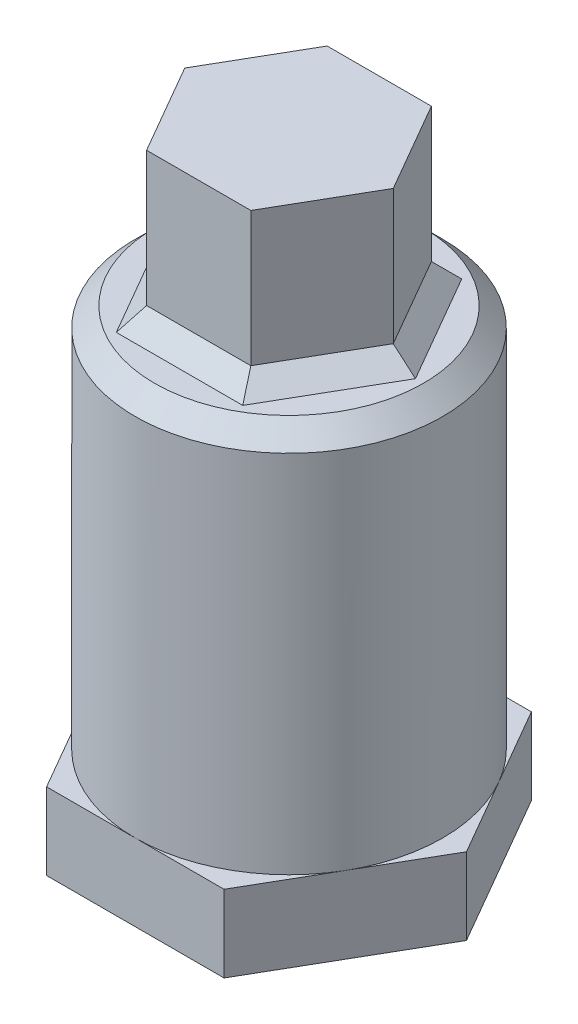
ISO-10303-21;
HEADER;
FILE_DESCRIPTION(('STEP AP214'),'2;1');
FILE_NAME('part.step','',(''),(''),'','','');
FILE_SCHEMA(('AUTOMOTIVE_DESIGN { 1 0 10303 214 1 1 1 1 }'));
ENDSEC;
DATA;
#1=APPLICATION_CONTEXT('core data for automotive mechanical design processes');
#2=APPLICATION_PROTOCOL_DEFINITION('international standard','automotive_design',2000,#1);
#3=PRODUCT_CONTEXT('',#1,'mechanical');
#4=PRODUCT('Part','Part','',(#3));
#5=PRODUCT_RELATED_PRODUCT_CATEGORY('part','',(#4));
#6=PRODUCT_DEFINITION_FORMATION('','',#4);
#7=PRODUCT_DEFINITION_CONTEXT('part definition',#1,'design');
#8=PRODUCT_DEFINITION('design','',#6,#7);
#9=PRODUCT_DEFINITION_SHAPE('','',#8);
#10=(LENGTH_UNIT() NAMED_UNIT(*) SI_UNIT(.MILLI.,.METRE.));
#11=(NAMED_UNIT(*) PLANE_ANGLE_UNIT() SI_UNIT($,.RADIAN.));
#12=(NAMED_UNIT(*) SI_UNIT($,.STERADIAN.) SOLID_ANGLE_UNIT());
#13=UNCERTAINTY_MEASURE_WITH_UNIT(LENGTH_MEASURE(1.E-05),#10,'distance_accuracy_value','');
#14=(GEOMETRIC_REPRESENTATION_CONTEXT(3) GLOBAL_UNCERTAINTY_ASSIGNED_CONTEXT((#13)) GLOBAL_UNIT_ASSIGNED_CONTEXT((#10,
#11,#12)) REPRESENTATION_CONTEXT('',''));
#15=CARTESIAN_POINT('',(0.,0.,0.));
#16=DIRECTION('',(0.,0.,1.));
#17=DIRECTION('',(1.,0.,0.));
#18=AXIS2_PLACEMENT_3D('',#15,#16,#17);
#19=CARTESIAN_POINT('',(2.71354626519129,8.,4.69999999999995));
#20=DIRECTION('',(-0.866025403784441,0.,-0.499999999999995));
#21=DIRECTION('',(-0.499999999999995,0.,0.866025403784442));
#22=AXIS2_PLACEMENT_3D('',#19,#20,#21);
#23=PLANE('',#22);
#24=DIRECTION('',(0.,-1.,0.));
#25=VECTOR('',#24,1.);
#26=CARTESIAN_POINT('',(2.71354626519129,8.,4.69999999999995));
#27=LINE('',#26,#25);
#28=CARTESIAN_POINT('',(2.71354626519129,8.,4.69999999999995));
#29=VERTEX_POINT('',#28);
#30=CARTESIAN_POINT('',(2.71354626519129,1.00000000000001,4.69999999999995));
#31=VERTEX_POINT('',#30);
#32=EDGE_CURVE('E235',#29,#31,#27,.T.);
#33=ORIENTED_EDGE('',*,*,#32,.T.);
#34=DIRECTION('',(0.499999999999995,0.,-0.866025403784442));
#35=VECTOR('',#34,1.);
#36=CARTESIAN_POINT('',(5.42709253038246,1.00000000000001,0.));
#37=LINE('',#36,#35);
#38=CARTESIAN_POINT('',(5.42709253038246,1.00000000000001,0.));
#39=VERTEX_POINT('',#38);
#40=EDGE_CURVE('E11',#31,#39,#37,.T.);
#41=ORIENTED_EDGE('',*,*,#40,.T.);
#42=DIRECTION('',(0.,-1.,0.));
#43=VECTOR('',#42,1.);
#44=CARTESIAN_POINT('',(5.42709253038246,8.,0.));
#45=LINE('',#44,#43);
#46=CARTESIAN_POINT('',(5.42709253038246,8.,0.));
#47=VERTEX_POINT('',#46);
#48=EDGE_CURVE('E253',#47,#39,#45,.T.);
#49=ORIENTED_EDGE('',*,*,#48,.F.);
#50=DIRECTION('',(0.499999999999995,0.,-0.866025403784441));
#51=VECTOR('',#50,1.);
#52=CARTESIAN_POINT('',(2.71354626519129,8.,4.69999999999995));
#53=LINE('',#52,#51);
#54=EDGE_CURVE('E216',#29,#47,#53,.T.);
#55=ORIENTED_EDGE('',*,*,#54,.F.);
#56=EDGE_LOOP('',(#33,#41,#49,#55));
#57=FACE_BOUND('',#56,.T.);
#58=ADVANCED_FACE('F41',(#57),#23,.F.);
#59=CARTESIAN_POINT('',(5.42709253038246,8.,0.));
#60=DIRECTION('',(-0.866025403784438,0.,0.500000000000001));
#61=DIRECTION('',(0.500000000000001,0.,0.866025403784438));
#62=AXIS2_PLACEMENT_3D('',#59,#60,#61);
#63=PLANE('',#62);
#64=ORIENTED_EDGE('',*,*,#48,.T.);
#65=DIRECTION('',(-0.500000000000001,0.,-0.866025403784438));
#66=VECTOR('',#65,1.);
#67=CARTESIAN_POINT('',(2.71354626519122,1.00000000000001,-4.69999999999999));
#68=LINE('',#67,#66);
#69=CARTESIAN_POINT('',(2.71354626519122,1.00000000000001,-4.69999999999999));
#70=VERTEX_POINT('',#69);
#71=EDGE_CURVE('E284',#39,#70,#68,.T.);
#72=ORIENTED_EDGE('',*,*,#71,.T.);
#73=DIRECTION('',(0.,-1.,0.));
#74=VECTOR('',#73,1.);
#75=CARTESIAN_POINT('',(2.71354626519122,8.,-4.69999999999999));
#76=LINE('',#75,#74);
#77=CARTESIAN_POINT('',(2.71354626519122,8.,-4.69999999999999));
#78=VERTEX_POINT('',#77);
#79=EDGE_CURVE('E249',#78,#70,#76,.T.);
#80=ORIENTED_EDGE('',*,*,#79,.F.);
#81=DIRECTION('',(-0.500000000000001,0.,-0.866025403784438));
#82=VECTOR('',#81,1.);
#83=CARTESIAN_POINT('',(5.42709253038246,8.,0.));
#84=LINE('',#83,#82);
#85=EDGE_CURVE('E220',#47,#78,#84,.T.);
#86=ORIENTED_EDGE('',*,*,#85,.F.);
#87=EDGE_LOOP('',(#64,#72,#80,#86));
#88=FACE_BOUND('',#87,.T.);
#89=ADVANCED_FACE('F342',(#88),#63,.F.);
#90=CARTESIAN_POINT('',(2.71354626519122,8.,-4.69999999999999));
#91=DIRECTION('',(0.,0.,1.));
#92=DIRECTION('',(1.,0.,0.));
#93=AXIS2_PLACEMENT_3D('',#90,#91,#92);
#94=PLANE('',#93);
#95=ORIENTED_EDGE('',*,*,#79,.T.);
#96=DIRECTION('',(-1.,0.,0.));
#97=VECTOR('',#96,1.);
#98=CARTESIAN_POINT('',(-2.71354626519125,1.00000000000001,-4.69999999999997));
#99=LINE('',#98,#97);
#100=CARTESIAN_POINT('',(-2.71354626519125,1.00000000000001,-4.69999999999997));
#101=VERTEX_POINT('',#100);
#102=EDGE_CURVE('E288',#70,#101,#99,.T.);
#103=ORIENTED_EDGE('',*,*,#102,.T.);
#104=DIRECTION('',(0.,-1.,0.));
#105=VECTOR('',#104,1.);
#106=CARTESIAN_POINT('',(-2.71354626519125,8.,-4.69999999999997));
#107=LINE('',#106,#105);
#108=CARTESIAN_POINT('',(-2.71354626519125,8.,-4.69999999999997));
#109=VERTEX_POINT('',#108);
#110=EDGE_CURVE('E245',#109,#101,#107,.T.);
#111=ORIENTED_EDGE('',*,*,#110,.F.);
#112=DIRECTION('',(-1.,0.,0.));
#113=VECTOR('',#112,1.);
#114=CARTESIAN_POINT('',(2.71354626519122,8.,-4.69999999999999));
#115=LINE('',#114,#113);
#116=EDGE_CURVE('E223',#78,#109,#115,.T.);
#117=ORIENTED_EDGE('',*,*,#116,.F.);
#118=EDGE_LOOP('',(#95,#103,#111,#117));
#119=FACE_BOUND('',#118,.T.);
#120=ADVANCED_FACE('F368',(#119),#94,.F.);
#121=CARTESIAN_POINT('',(-2.71354626519125,8.,-4.69999999999997));
#122=DIRECTION('',(0.866025403784442,0.,0.499999999999995));
#123=DIRECTION('',(0.499999999999995,0.,-0.866025403784442));
#124=AXIS2_PLACEMENT_3D('',#121,#122,#123);
#125=PLANE('',#124);
#126=ORIENTED_EDGE('',*,*,#110,.T.);
#127=DIRECTION('',(-0.499999999999995,0.,0.866025403784442));
#128=VECTOR('',#127,1.);
#129=CARTESIAN_POINT('',(-5.42709253038246,1.00000000000001,0.));
#130=LINE('',#129,#128);
#131=CARTESIAN_POINT('',(-5.42709253038246,1.00000000000001,0.));
#132=VERTEX_POINT('',#131);
#133=EDGE_CURVE('E291',#101,#132,#130,.T.);
#134=ORIENTED_EDGE('',*,*,#133,.T.);
#135=DIRECTION('',(0.,-1.,0.));
#136=VECTOR('',#135,1.);
#137=CARTESIAN_POINT('',(-5.42709253038246,8.,0.));
#138=LINE('',#137,#136);
#139=CARTESIAN_POINT('',(-5.42709253038246,8.,0.));
#140=VERTEX_POINT('',#139);
#141=EDGE_CURVE('E241',#140,#132,#138,.T.);
#142=ORIENTED_EDGE('',*,*,#141,.F.);
#143=DIRECTION('',(-0.499999999999995,0.,0.866025403784442));
#144=VECTOR('',#143,1.);
#145=CARTESIAN_POINT('',(-2.71354626519125,8.,-4.69999999999997));
#146=LINE('',#145,#144);
#147=EDGE_CURVE('E226',#109,#140,#146,.T.);
#148=ORIENTED_EDGE('',*,*,#147,.F.);
#149=EDGE_LOOP('',(#126,#134,#142,#148));
#150=FACE_BOUND('',#149,.T.);
#151=ADVANCED_FACE('F360',(#150),#125,.F.);
#152=CARTESIAN_POINT('',(-5.42709253038246,8.,0.));
#153=DIRECTION('',(0.866025403784435,0.,-0.500000000000007));
#154=DIRECTION('',(-0.500000000000007,0.,-0.866025403784434));
#155=AXIS2_PLACEMENT_3D('',#152,#153,#154);
#156=PLANE('',#155);
#157=ORIENTED_EDGE('',*,*,#141,.T.);
#158=DIRECTION('',(0.500000000000007,0.,0.866025403784434));
#159=VECTOR('',#158,1.);
#160=CARTESIAN_POINT('',(-2.71354626519119,1.00000000000001,4.70000000000001));
#161=LINE('',#160,#159);
#162=CARTESIAN_POINT('',(-2.71354626519119,1.00000000000001,4.70000000000001));
#163=VERTEX_POINT('',#162);
#164=EDGE_CURVE('E294',#132,#163,#161,.T.);
#165=ORIENTED_EDGE('',*,*,#164,.T.);
#166=DIRECTION('',(0.,-1.,0.));
#167=VECTOR('',#166,1.);
#168=CARTESIAN_POINT('',(-2.71354626519119,8.,4.70000000000001));
#169=LINE('',#168,#167);
#170=CARTESIAN_POINT('',(-2.71354626519119,8.,4.70000000000001));
#171=VERTEX_POINT('',#170);
#172=EDGE_CURVE('E238',#171,#163,#169,.T.);
#173=ORIENTED_EDGE('',*,*,#172,.F.);
#174=DIRECTION('',(0.500000000000007,0.,0.866025403784434));
#175=VECTOR('',#174,1.);
#176=CARTESIAN_POINT('',(-5.42709253038246,8.,0.));
#177=LINE('',#176,#175);
#178=EDGE_CURVE('E229',#140,#171,#177,.T.);
#179=ORIENTED_EDGE('',*,*,#178,.F.);
#180=EDGE_LOOP('',(#157,#165,#173,#179));
#181=FACE_BOUND('',#180,.T.);
#182=ADVANCED_FACE('F352',(#181),#156,.F.);
#183=CARTESIAN_POINT('',(-2.71354626519119,8.,4.70000000000001));
#184=DIRECTION('',(0.,0.,-1.));
#185=DIRECTION('',(-1.,0.,0.));
#186=AXIS2_PLACEMENT_3D('',#183,#184,#185);
#187=PLANE('',#186);
#188=ORIENTED_EDGE('',*,*,#172,.T.);
#189=DIRECTION('',(1.,0.,0.));
#190=VECTOR('',#189,1.);
#191=CARTESIAN_POINT('',(2.71354626519129,1.00000000000001,4.69999999999995));
#192=LINE('',#191,#190);
#193=EDGE_CURVE('E52',#163,#31,#192,.T.);
#194=ORIENTED_EDGE('',*,*,#193,.T.);
#195=ORIENTED_EDGE('',*,*,#32,.F.);
#196=DIRECTION('',(1.,0.,0.));
#197=VECTOR('',#196,1.);
#198=CARTESIAN_POINT('',(-2.71354626519119,8.,4.70000000000001));
#199=LINE('',#198,#197);
#200=EDGE_CURVE('E232',#171,#29,#199,.T.);
#201=ORIENTED_EDGE('',*,*,#200,.F.);
#202=EDGE_LOOP('',(#188,#194,#195,#201));
#203=FACE_BOUND('',#202,.T.);
#204=ADVANCED_FACE('F350',(#203),#187,.F.);
#205=CARTESIAN_POINT('',(0.,8.,0.));
#206=DIRECTION('',(0.,1.,0.));
#207=DIRECTION('',(0.,0.,1.));
#208=AXIS2_PLACEMENT_3D('',#205,#206,#207);
#209=PLANE('',#208);
#210=ORIENTED_EDGE('',*,*,#54,.T.);
#211=ORIENTED_EDGE('',*,*,#85,.T.);
#212=ORIENTED_EDGE('',*,*,#116,.T.);
#213=ORIENTED_EDGE('',*,*,#147,.T.);
#214=ORIENTED_EDGE('',*,*,#178,.T.);
#215=ORIENTED_EDGE('',*,*,#200,.T.);
#216=EDGE_LOOP('',(#210,#211,#212,#213,#214,#215));
#217=FACE_BOUND('',#216,.T.);
#218=ADVANCED_FACE('F346',(#217),#209,.T.);
#219=CARTESIAN_POINT('',(0.,-20.,0.));
#220=DIRECTION('',(0.,1.,0.));
#221=DIRECTION('',(0.,0.,1.));
#222=AXIS2_PLACEMENT_3D('',#219,#220,#221);
#223=CYLINDRICAL_SURFACE('',#222,8.);
#224=CARTESIAN_POINT('',(0.,-0.99999999999999,0.));
#225=DIRECTION('',(0.,-1.,0.));
#226=DIRECTION('',(0.,0.,-1.));
#227=AXIS2_PLACEMENT_3D('',#224,#225,#226);
#228=CIRCLE('',#227,8.);
#229=CARTESIAN_POINT('',(0.,-0.99999999999999,-8.));
#230=VERTEX_POINT('',#229);
#231=EDGE_CURVE('E257',#230,#230,#228,.T.);
#232=ORIENTED_EDGE('',*,*,#231,.T.);
#233=EDGE_LOOP('',(#232));
#234=FACE_BOUND('',#233,.T.);
#235=CARTESIAN_POINT('',(0.,-20.,0.));
#236=DIRECTION('',(0.,1.,0.));
#237=DIRECTION('',(0.,0.,1.));
#238=AXIS2_PLACEMENT_3D('',#235,#236,#237);
#239=CIRCLE('',#238,8.);
#240=CARTESIAN_POINT('',(0.,-20.,8.));
#241=VERTEX_POINT('',#240);
#242=CARTESIAN_POINT('',(6.92820323027551,-20.,4.));
#243=VERTEX_POINT('',#242);
#244=EDGE_CURVE('E207',#241,#243,#239,.T.);
#245=ORIENTED_EDGE('',*,*,#244,.T.);
#246=CARTESIAN_POINT('',(6.92820323027551,-20.,-4.));
#247=VERTEX_POINT('',#246);
#248=EDGE_CURVE('E215',#243,#247,#239,.T.);
#249=ORIENTED_EDGE('',*,*,#248,.T.);
#250=CARTESIAN_POINT('',(0.,-20.,-8.));
#251=VERTEX_POINT('',#250);
#252=EDGE_CURVE('E623',#247,#251,#239,.T.);
#253=ORIENTED_EDGE('',*,*,#252,.T.);
#254=CARTESIAN_POINT('',(-6.92820323027551,-20.,-4.));
#255=VERTEX_POINT('',#254);
#256=EDGE_CURVE('E620',#251,#255,#239,.T.);
#257=ORIENTED_EDGE('',*,*,#256,.T.);
#258=CARTESIAN_POINT('',(-6.92820323027551,-20.,4.));
#259=VERTEX_POINT('',#258);
#260=EDGE_CURVE('E205',#255,#259,#239,.T.);
#261=ORIENTED_EDGE('',*,*,#260,.T.);
#262=EDGE_CURVE('E200',#259,#241,#239,.T.);
#263=ORIENTED_EDGE('',*,*,#262,.T.);
#264=EDGE_LOOP('',(#245,#249,#253,#257,#261,#263));
#265=FACE_BOUND('',#264,.T.);
#266=ADVANCED_FACE('F358',(#234,#265),#223,.T.);
#267=CARTESIAN_POINT('',(0.,0.,0.));
#268=DIRECTION('',(0.,-1.,0.));
#269=DIRECTION('',(0.,0.,-1.));
#270=AXIS2_PLACEMENT_3D('',#267,#268,#269);
#271=PLANE('',#270);
#272=CARTESIAN_POINT('',(0.,0.,0.));
#273=DIRECTION('',(0.,-1.,0.));
#274=DIRECTION('',(0.,0.,-1.));
#275=AXIS2_PLACEMENT_3D('',#272,#273,#274);
#276=CIRCLE('',#275,7.00000000000001);
#277=CARTESIAN_POINT('',(0.,0.,-7.00000000000001));
#278=VERTEX_POINT('',#277);
#279=EDGE_CURVE('E280',#278,#278,#276,.F.);
#280=ORIENTED_EDGE('',*,*,#279,.T.);
#281=EDGE_LOOP('',(#280));
#282=FACE_BOUND('',#281,.T.);
#283=DIRECTION('',(1.,0.,0.));
#284=VECTOR('',#283,1.);
#285=CARTESIAN_POINT('',(2.71354626519122,0.,-5.69999999999999));
#286=LINE('',#285,#284);
#287=CARTESIAN_POINT('',(-3.29089653438088,0.,-5.69999999999997));
#288=VERTEX_POINT('',#287);
#289=CARTESIAN_POINT('',(3.29089653438085,0.,-5.69999999999999));
#290=VERTEX_POINT('',#289);
#291=EDGE_CURVE('E273',#288,#290,#286,.T.);
#292=ORIENTED_EDGE('',*,*,#291,.T.);
#293=DIRECTION('',(0.500000000000001,0.,0.866025403784438));
#294=VECTOR('',#293,1.);
#295=CARTESIAN_POINT('',(6.2931179341669,0.,-0.500000000000002));
#296=LINE('',#295,#294);
#297=CARTESIAN_POINT('',(6.58179306876172,0.,0.));
#298=VERTEX_POINT('',#297);
#299=EDGE_CURVE('E276',#290,#298,#296,.T.);
#300=ORIENTED_EDGE('',*,*,#299,.T.);
#301=DIRECTION('',(-0.499999999999995,0.,0.866025403784442));
#302=VECTOR('',#301,1.);
#303=CARTESIAN_POINT('',(3.57957166897573,0.,5.19999999999995));
#304=LINE('',#303,#302);
#305=CARTESIAN_POINT('',(3.29089653438092,0.,5.69999999999995));
#306=VERTEX_POINT('',#305);
#307=EDGE_CURVE('E261',#298,#306,#304,.T.);
#308=ORIENTED_EDGE('',*,*,#307,.T.);
#309=DIRECTION('',(-1.,0.,0.));
#310=VECTOR('',#309,1.);
#311=CARTESIAN_POINT('',(-2.71354626519118,0.,5.70000000000001));
#312=LINE('',#311,#310);
#313=CARTESIAN_POINT('',(-3.29089653438081,0.,5.70000000000002));
#314=VERTEX_POINT('',#313);
#315=EDGE_CURVE('E264',#306,#314,#312,.T.);
#316=ORIENTED_EDGE('',*,*,#315,.T.);
#317=DIRECTION('',(-0.500000000000007,0.,-0.866025403784435));
#318=VECTOR('',#317,1.);
#319=CARTESIAN_POINT('',(-6.2931179341669,0.,0.500000000000046));
#320=LINE('',#319,#318);
#321=CARTESIAN_POINT('',(-6.58179306876172,0.,0.));
#322=VERTEX_POINT('',#321);
#323=EDGE_CURVE('E267',#314,#322,#320,.T.);
#324=ORIENTED_EDGE('',*,*,#323,.T.);
#325=DIRECTION('',(0.499999999999995,0.,-0.866025403784442));
#326=VECTOR('',#325,1.);
#327=CARTESIAN_POINT('',(-3.5795716689757,0.,-5.19999999999997));
#328=LINE('',#327,#326);
#329=EDGE_CURVE('E270',#322,#288,#328,.T.);
#330=ORIENTED_EDGE('',*,*,#329,.T.);
#331=EDGE_LOOP('',(#292,#300,#308,#316,#324,#330));
#332=FACE_BOUND('',#331,.T.);
#333=ADVANCED_FACE('F329',(#282,#332),#271,.F.);
#334=CARTESIAN_POINT('',(0.,-0.99999999999999,0.));
#335=DIRECTION('',(0.,-1.,0.));
#336=DIRECTION('',(0.,0.,-1.));
#337=AXIS2_PLACEMENT_3D('',#334,#335,#336);
#338=CONICAL_SURFACE('',#337,8.,0.78539816339745);
#339=ORIENTED_EDGE('',*,*,#279,.F.);
#340=EDGE_LOOP('',(#339));
#341=FACE_BOUND('',#340,.T.);
#342=ORIENTED_EDGE('',*,*,#231,.F.);
#343=EDGE_LOOP('',(#342));
#344=FACE_BOUND('',#343,.T.);
#345=ADVANCED_FACE('F373',(#341,#344),#338,.T.);
#346=CARTESIAN_POINT('',(-5.42709253038246,1.00000000000001,0.));
#347=DIRECTION('',(-0.612372435695794,0.707106781186544,0.35355339059328));
#348=DIRECTION('',(-0.500000000000007,0.,-0.866025403784434));
#349=AXIS2_PLACEMENT_3D('',#346,#347,#348);
#350=PLANE('',#349);
#351=DIRECTION('',(-0.755928946018452,-0.65465367070798,0.));
#352=VECTOR('',#351,1.);
#353=CARTESIAN_POINT('',(-5.42709253038246,1.00000000000001,0.));
#354=LINE('',#353,#352);
#355=EDGE_CURVE('E311',#322,#132,#354,.F.);
#356=ORIENTED_EDGE('',*,*,#355,.F.);
#357=ORIENTED_EDGE('',*,*,#323,.F.);
#358=DIRECTION('',(-0.37796447300922,-0.65465367070798,0.654653670707978));
#359=VECTOR('',#358,1.);
#360=CARTESIAN_POINT('',(-2.71354626519119,1.00000000000001,4.70000000000001));
#361=LINE('',#360,#359);
#362=EDGE_CURVE('E46',#163,#314,#361,.T.);
#363=ORIENTED_EDGE('',*,*,#362,.F.);
#364=ORIENTED_EDGE('',*,*,#164,.F.);
#365=EDGE_LOOP('',(#356,#357,#363,#364));
#366=FACE_BOUND('',#365,.T.);
#367=ADVANCED_FACE('F44',(#366),#350,.T.);
#368=CARTESIAN_POINT('',(-2.71354626519119,1.00000000000001,4.70000000000001));
#369=DIRECTION('',(0.,0.707106781186544,0.707106781186551));
#370=DIRECTION('',(-1.,0.,0.));
#371=AXIS2_PLACEMENT_3D('',#368,#369,#370);
#372=PLANE('',#371);
#373=ORIENTED_EDGE('',*,*,#362,.T.);
#374=ORIENTED_EDGE('',*,*,#315,.F.);
#375=DIRECTION('',(0.37796447300923,-0.654653670707981,0.654653670707971));
#376=VECTOR('',#375,1.);
#377=CARTESIAN_POINT('',(2.71354626519129,1.00000000000001,4.69999999999995));
#378=LINE('',#377,#376);
#379=EDGE_CURVE('E308',#31,#306,#378,.T.);
#380=ORIENTED_EDGE('',*,*,#379,.F.);
#381=ORIENTED_EDGE('',*,*,#193,.F.);
#382=EDGE_LOOP('',(#373,#374,#380,#381));
#383=FACE_BOUND('',#382,.T.);
#384=ADVANCED_FACE('F323',(#383),#372,.T.);
#385=CARTESIAN_POINT('',(-2.71354626519125,1.00000000000001,-4.69999999999997));
#386=DIRECTION('',(-0.6123724356958,0.707106781186544,-0.353553390593272));
#387=DIRECTION('',(0.499999999999995,0.,-0.866025403784442));
#388=AXIS2_PLACEMENT_3D('',#385,#386,#387);
#389=PLANE('',#388);
#390=ORIENTED_EDGE('',*,*,#355,.T.);
#391=ORIENTED_EDGE('',*,*,#133,.F.);
#392=DIRECTION('',(-0.377964473009229,-0.654653670707981,-0.654653670707973));
#393=VECTOR('',#392,1.);
#394=CARTESIAN_POINT('',(-2.71354626519125,1.00000000000001,-4.69999999999997));
#395=LINE('',#394,#393);
#396=EDGE_CURVE('E304',#288,#101,#395,.F.);
#397=ORIENTED_EDGE('',*,*,#396,.F.);
#398=ORIENTED_EDGE('',*,*,#329,.F.);
#399=EDGE_LOOP('',(#390,#391,#397,#398));
#400=FACE_BOUND('',#399,.T.);
#401=ADVANCED_FACE('F400',(#400),#389,.T.);
#402=CARTESIAN_POINT('',(2.71354626519129,1.00000000000001,4.69999999999995));
#403=DIRECTION('',(0.6123724356958,0.707106781186544,0.353553390593272));
#404=DIRECTION('',(-0.499999999999995,0.,0.866025403784442));
#405=AXIS2_PLACEMENT_3D('',#402,#403,#404);
#406=PLANE('',#405);
#407=ORIENTED_EDGE('',*,*,#379,.T.);
#408=ORIENTED_EDGE('',*,*,#307,.F.);
#409=DIRECTION('',(-0.755928946018451,0.654653670707981,0.));
#410=VECTOR('',#409,1.);
#411=CARTESIAN_POINT('',(3.87649466455894,2.34285714285714,0.));
#412=LINE('',#411,#410);
#413=EDGE_CURVE('E301',#39,#298,#412,.F.);
#414=ORIENTED_EDGE('',*,*,#413,.F.);
#415=ORIENTED_EDGE('',*,*,#40,.F.);
#416=EDGE_LOOP('',(#407,#408,#414,#415));
#417=FACE_BOUND('',#416,.T.);
#418=ADVANCED_FACE('F335',(#417),#406,.T.);
#419=CARTESIAN_POINT('',(2.71354626519122,1.00000000000001,-4.69999999999999));
#420=DIRECTION('',(0.,0.707106781186544,-0.707106781186551));
#421=DIRECTION('',(1.,0.,0.));
#422=AXIS2_PLACEMENT_3D('',#419,#420,#421);
#423=PLANE('',#422);
#424=ORIENTED_EDGE('',*,*,#396,.T.);
#425=ORIENTED_EDGE('',*,*,#102,.F.);
#426=DIRECTION('',(0.377964473009225,-0.65465367070798,-0.654653670707975));
#427=VECTOR('',#426,1.);
#428=CARTESIAN_POINT('',(2.71354626519122,1.00000000000001,-4.69999999999999));
#429=LINE('',#428,#427);
#430=EDGE_CURVE('E214',#290,#70,#429,.F.);
#431=ORIENTED_EDGE('',*,*,#430,.F.);
#432=ORIENTED_EDGE('',*,*,#291,.F.);
#433=EDGE_LOOP('',(#424,#425,#431,#432));
#434=FACE_BOUND('',#433,.T.);
#435=ADVANCED_FACE('F387',(#434),#423,.T.);
#436=CARTESIAN_POINT('',(5.42709253038246,1.00000000000001,0.));
#437=DIRECTION('',(0.612372435695797,0.707106781186544,-0.353553390593276));
#438=DIRECTION('',(0.500000000000001,0.,0.866025403784438));
#439=AXIS2_PLACEMENT_3D('',#436,#437,#438);
#440=PLANE('',#439);
#441=ORIENTED_EDGE('',*,*,#413,.T.);
#442=ORIENTED_EDGE('',*,*,#299,.F.);
#443=ORIENTED_EDGE('',*,*,#430,.T.);
#444=ORIENTED_EDGE('',*,*,#71,.F.);
#445=EDGE_LOOP('',(#441,#442,#443,#444));
#446=FACE_BOUND('',#445,.T.);
#447=ADVANCED_FACE('F380',(#446),#440,.T.);
#448=CARTESIAN_POINT('',(0.,-20.,0.));
#449=DIRECTION('',(0.,-1.,0.));
#450=DIRECTION('',(0.,0.,-1.));
#451=AXIS2_PLACEMENT_3D('',#448,#449,#450);
#452=PLANE('',#451);
#453=ORIENTED_EDGE('',*,*,#244,.F.);
#454=DIRECTION('',(-1.,0.,0.));
#455=VECTOR('',#454,1.);
#456=CARTESIAN_POINT('',(4.61880215351701,-20.,8.));
#457=LINE('',#456,#455);
#458=CARTESIAN_POINT('',(4.61880215351701,-20.,8.));
#459=VERTEX_POINT('',#458);
#460=EDGE_CURVE('E60',#459,#241,#457,.T.);
#461=ORIENTED_EDGE('',*,*,#460,.F.);
#462=DIRECTION('',(-0.5,0.,0.866025403784439));
#463=VECTOR('',#462,1.);
#464=CARTESIAN_POINT('',(9.23760430703402,-20.,0.));
#465=LINE('',#464,#463);
#466=EDGE_CURVE('E634',#243,#459,#465,.T.);
#467=ORIENTED_EDGE('',*,*,#466,.F.);
#468=EDGE_LOOP('',(#453,#461,#467));
#469=FACE_BOUND('',#468,.T.);
#470=ADVANCED_FACE('F386',(#469),#452,.F.);
#471=ORIENTED_EDGE('',*,*,#248,.F.);
#472=CARTESIAN_POINT('',(9.23760430703402,-20.,0.));
#473=VERTEX_POINT('',#472);
#474=EDGE_CURVE('E631',#473,#243,#465,.T.);
#475=ORIENTED_EDGE('',*,*,#474,.F.);
#476=DIRECTION('',(0.5,0.,0.866025403784439));
#477=VECTOR('',#476,1.);
#478=CARTESIAN_POINT('',(4.61880215351701,-20.,-8.));
#479=LINE('',#478,#477);
#480=EDGE_CURVE('E632',#247,#473,#479,.T.);
#481=ORIENTED_EDGE('',*,*,#480,.F.);
#482=EDGE_LOOP('',(#471,#475,#481));
#483=FACE_BOUND('',#482,.T.);
#484=ADVANCED_FACE('F493',(#483),#452,.F.);
#485=ORIENTED_EDGE('',*,*,#252,.F.);
#486=CARTESIAN_POINT('',(4.61880215351701,-20.,-8.));
#487=VERTEX_POINT('',#486);
#488=EDGE_CURVE('E637',#487,#247,#479,.T.);
#489=ORIENTED_EDGE('',*,*,#488,.F.);
#490=DIRECTION('',(1.,0.,0.));
#491=VECTOR('',#490,1.);
#492=CARTESIAN_POINT('',(-4.61880215351701,-20.,-8.));
#493=LINE('',#492,#491);
#494=EDGE_CURVE('E663',#251,#487,#493,.T.);
#495=ORIENTED_EDGE('',*,*,#494,.F.);
#496=EDGE_LOOP('',(#485,#489,#495));
#497=FACE_BOUND('',#496,.T.);
#498=ADVANCED_FACE('F504',(#497),#452,.F.);
#499=ORIENTED_EDGE('',*,*,#256,.F.);
#500=CARTESIAN_POINT('',(-4.61880215351701,-20.,-8.));
#501=VERTEX_POINT('',#500);
#502=EDGE_CURVE('E667',#501,#251,#493,.T.);
#503=ORIENTED_EDGE('',*,*,#502,.F.);
#504=DIRECTION('',(0.5,0.,-0.866025403784439));
#505=VECTOR('',#504,1.);
#506=CARTESIAN_POINT('',(-9.23760430703402,-20.,0.));
#507=LINE('',#506,#505);
#508=EDGE_CURVE('E617',#255,#501,#507,.T.);
#509=ORIENTED_EDGE('',*,*,#508,.F.);
#510=EDGE_LOOP('',(#499,#503,#509));
#511=FACE_BOUND('',#510,.T.);
#512=ADVANCED_FACE('F513',(#511),#452,.F.);
#513=ORIENTED_EDGE('',*,*,#260,.F.);
#514=CARTESIAN_POINT('',(-9.23760430703402,-20.,0.));
#515=VERTEX_POINT('',#514);
#516=EDGE_CURVE('E612',#515,#255,#507,.T.);
#517=ORIENTED_EDGE('',*,*,#516,.F.);
#518=DIRECTION('',(-0.5,0.,-0.866025403784439));
#519=VECTOR('',#518,1.);
#520=CARTESIAN_POINT('',(-4.61880215351701,-20.,8.));
#521=LINE('',#520,#519);
#522=EDGE_CURVE('E197',#259,#515,#521,.T.);
#523=ORIENTED_EDGE('',*,*,#522,.F.);
#524=EDGE_LOOP('',(#513,#517,#523));
#525=FACE_BOUND('',#524,.T.);
#526=ADVANCED_FACE('F522',(#525),#452,.F.);
#527=CARTESIAN_POINT('',(-4.61880215351701,-24.,8.));
#528=DIRECTION('',(0.866025403784439,0.,-0.5));
#529=DIRECTION('',(-0.5,0.,-0.866025403784439));
#530=AXIS2_PLACEMENT_3D('',#527,#528,#529);
#531=PLANE('',#530);
#532=CARTESIAN_POINT('',(-4.61880215351701,-20.,8.));
#533=VERTEX_POINT('',#532);
#534=EDGE_CURVE('E606',#533,#259,#521,.T.);
#535=ORIENTED_EDGE('',*,*,#534,.T.);
#536=ORIENTED_EDGE('',*,*,#522,.T.);
#537=DIRECTION('',(0.,1.,0.));
#538=VECTOR('',#537,1.);
#539=CARTESIAN_POINT('',(-9.23760430703402,-24.,0.));
#540=LINE('',#539,#538);
#541=CARTESIAN_POINT('',(-9.23760430703402,-24.,0.));
#542=VERTEX_POINT('',#541);
#543=EDGE_CURVE('E176',#542,#515,#540,.T.);
#544=ORIENTED_EDGE('',*,*,#543,.F.);
#545=DIRECTION('',(-0.5,0.,-0.866025403784439));
#546=VECTOR('',#545,1.);
#547=CARTESIAN_POINT('',(-4.61880215351701,-24.,8.));
#548=LINE('',#547,#546);
#549=CARTESIAN_POINT('',(-4.61880215351701,-24.,8.));
#550=VERTEX_POINT('',#549);
#551=EDGE_CURVE('E183',#550,#542,#548,.T.);
#552=ORIENTED_EDGE('',*,*,#551,.F.);
#553=DIRECTION('',(0.,1.,0.));
#554=VECTOR('',#553,1.);
#555=CARTESIAN_POINT('',(-4.61880215351701,-24.,8.));
#556=LINE('',#555,#554);
#557=EDGE_CURVE('E615',#550,#533,#556,.T.);
#558=ORIENTED_EDGE('',*,*,#557,.T.);
#559=EDGE_LOOP('',(#535,#536,#544,#552,#558));
#560=FACE_BOUND('',#559,.T.);
#561=ADVANCED_FACE('F195',(#560),#531,.F.);
#562=CARTESIAN_POINT('',(-9.23760430703402,-24.,0.));
#563=DIRECTION('',(0.866025403784439,0.,0.5));
#564=DIRECTION('',(0.5,0.,-0.866025403784439));
#565=AXIS2_PLACEMENT_3D('',#562,#563,#564);
#566=PLANE('',#565);
#567=ORIENTED_EDGE('',*,*,#516,.T.);
#568=ORIENTED_EDGE('',*,*,#508,.T.);
#569=DIRECTION('',(0.,1.,0.));
#570=VECTOR('',#569,1.);
#571=CARTESIAN_POINT('',(-4.61880215351701,-24.,-8.));
#572=LINE('',#571,#570);
#573=CARTESIAN_POINT('',(-4.61880215351701,-24.,-8.));
#574=VERTEX_POINT('',#573);
#575=EDGE_CURVE('E178',#574,#501,#572,.T.);
#576=ORIENTED_EDGE('',*,*,#575,.F.);
#577=DIRECTION('',(0.5,0.,-0.866025403784439));
#578=VECTOR('',#577,1.);
#579=CARTESIAN_POINT('',(-9.23760430703402,-24.,0.));
#580=LINE('',#579,#578);
#581=EDGE_CURVE('E171',#542,#574,#580,.T.);
#582=ORIENTED_EDGE('',*,*,#581,.F.);
#583=ORIENTED_EDGE('',*,*,#543,.T.);
#584=EDGE_LOOP('',(#567,#568,#576,#582,#583));
#585=FACE_BOUND('',#584,.T.);
#586=ADVANCED_FACE('F174',(#585),#566,.F.);
#587=CARTESIAN_POINT('',(-4.61880215351701,-24.,-8.));
#588=DIRECTION('',(0.,0.,1.));
#589=DIRECTION('',(1.,0.,0.));
#590=AXIS2_PLACEMENT_3D('',#587,#588,#589);
#591=PLANE('',#590);
#592=ORIENTED_EDGE('',*,*,#502,.T.);
#593=ORIENTED_EDGE('',*,*,#494,.T.);
#594=DIRECTION('',(0.,1.,0.));
#595=VECTOR('',#594,1.);
#596=CARTESIAN_POINT('',(4.61880215351701,-24.,-8.));
#597=LINE('',#596,#595);
#598=CARTESIAN_POINT('',(4.61880215351701,-24.,-8.));
#599=VERTEX_POINT('',#598);
#600=EDGE_CURVE('E208',#599,#487,#597,.T.);
#601=ORIENTED_EDGE('',*,*,#600,.F.);
#602=DIRECTION('',(1.,0.,0.));
#603=VECTOR('',#602,1.);
#604=CARTESIAN_POINT('',(-4.61880215351701,-24.,-8.));
#605=LINE('',#604,#603);
#606=EDGE_CURVE('E182',#574,#599,#605,.T.);
#607=ORIENTED_EDGE('',*,*,#606,.F.);
#608=ORIENTED_EDGE('',*,*,#575,.T.);
#609=EDGE_LOOP('',(#592,#593,#601,#607,#608));
#610=FACE_BOUND('',#609,.T.);
#611=ADVANCED_FACE('F547',(#610),#591,.F.);
#612=CARTESIAN_POINT('',(4.61880215351701,-24.,-8.));
#613=DIRECTION('',(-0.866025403784439,0.,0.5));
#614=DIRECTION('',(0.5,0.,0.866025403784439));
#615=AXIS2_PLACEMENT_3D('',#612,#613,#614);
#616=PLANE('',#615);
#617=ORIENTED_EDGE('',*,*,#488,.T.);
#618=ORIENTED_EDGE('',*,*,#480,.T.);
#619=DIRECTION('',(0.,1.,0.));
#620=VECTOR('',#619,1.);
#621=CARTESIAN_POINT('',(9.23760430703402,-24.,0.));
#622=LINE('',#621,#620);
#623=CARTESIAN_POINT('',(9.23760430703402,-24.,0.));
#624=VERTEX_POINT('',#623);
#625=EDGE_CURVE('E642',#624,#473,#622,.T.);
#626=ORIENTED_EDGE('',*,*,#625,.F.);
#627=DIRECTION('',(0.5,0.,0.866025403784439));
#628=VECTOR('',#627,1.);
#629=CARTESIAN_POINT('',(4.61880215351701,-24.,-8.));
#630=LINE('',#629,#628);
#631=EDGE_CURVE('E661',#599,#624,#630,.T.);
#632=ORIENTED_EDGE('',*,*,#631,.F.);
#633=ORIENTED_EDGE('',*,*,#600,.T.);
#634=EDGE_LOOP('',(#617,#618,#626,#632,#633));
#635=FACE_BOUND('',#634,.T.);
#636=ADVANCED_FACE('F556',(#635),#616,.F.);
#637=CARTESIAN_POINT('',(9.23760430703402,-24.,0.));
#638=DIRECTION('',(-0.866025403784439,0.,-0.5));
#639=DIRECTION('',(-0.5,0.,0.866025403784439));
#640=AXIS2_PLACEMENT_3D('',#637,#638,#639);
#641=PLANE('',#640);
#642=ORIENTED_EDGE('',*,*,#474,.T.);
#643=ORIENTED_EDGE('',*,*,#466,.T.);
#644=DIRECTION('',(0.,1.,0.));
#645=VECTOR('',#644,1.);
#646=CARTESIAN_POINT('',(4.61880215351701,-24.,8.));
#647=LINE('',#646,#645);
#648=CARTESIAN_POINT('',(4.61880215351701,-24.,8.));
#649=VERTEX_POINT('',#648);
#650=EDGE_CURVE('E652',#649,#459,#647,.T.);
#651=ORIENTED_EDGE('',*,*,#650,.F.);
#652=DIRECTION('',(-0.5,0.,0.866025403784439));
#653=VECTOR('',#652,1.);
#654=CARTESIAN_POINT('',(9.23760430703402,-24.,0.));
#655=LINE('',#654,#653);
#656=EDGE_CURVE('E676',#624,#649,#655,.T.);
#657=ORIENTED_EDGE('',*,*,#656,.F.);
#658=ORIENTED_EDGE('',*,*,#625,.T.);
#659=EDGE_LOOP('',(#642,#643,#651,#657,#658));
#660=FACE_BOUND('',#659,.T.);
#661=ADVANCED_FACE('F566',(#660),#641,.F.);
#662=CARTESIAN_POINT('',(4.61880215351701,-24.,8.));
#663=DIRECTION('',(0.,0.,-1.));
#664=DIRECTION('',(-1.,0.,0.));
#665=AXIS2_PLACEMENT_3D('',#662,#663,#664);
#666=PLANE('',#665);
#667=ORIENTED_EDGE('',*,*,#460,.T.);
#668=EDGE_CURVE('E607',#241,#533,#457,.T.);
#669=ORIENTED_EDGE('',*,*,#668,.T.);
#670=ORIENTED_EDGE('',*,*,#557,.F.);
#671=DIRECTION('',(-1.,0.,0.));
#672=VECTOR('',#671,1.);
#673=CARTESIAN_POINT('',(4.61880215351701,-24.,8.));
#674=LINE('',#673,#672);
#675=EDGE_CURVE('E188',#649,#550,#674,.T.);
#676=ORIENTED_EDGE('',*,*,#675,.F.);
#677=ORIENTED_EDGE('',*,*,#650,.T.);
#678=EDGE_LOOP('',(#667,#669,#670,#676,#677));
#679=FACE_BOUND('',#678,.T.);
#680=ADVANCED_FACE('F576',(#679),#666,.F.);
#681=CARTESIAN_POINT('',(0.,-24.,0.));
#682=DIRECTION('',(0.,-1.,0.));
#683=DIRECTION('',(0.,0.,-1.));
#684=AXIS2_PLACEMENT_3D('',#681,#682,#683);
#685=PLANE('',#684);
#686=ORIENTED_EDGE('',*,*,#551,.T.);
#687=ORIENTED_EDGE('',*,*,#581,.T.);
#688=ORIENTED_EDGE('',*,*,#606,.T.);
#689=ORIENTED_EDGE('',*,*,#631,.T.);
#690=ORIENTED_EDGE('',*,*,#656,.T.);
#691=ORIENTED_EDGE('',*,*,#675,.T.);
#692=EDGE_LOOP('',(#686,#687,#688,#689,#690,#691));
#693=FACE_BOUND('',#692,.T.);
#694=ADVANCED_FACE('F186',(#693),#685,.T.);
#695=ORIENTED_EDGE('',*,*,#262,.F.);
#696=ORIENTED_EDGE('',*,*,#534,.F.);
#697=ORIENTED_EDGE('',*,*,#668,.F.);
#698=EDGE_LOOP('',(#695,#696,#697));
#699=FACE_BOUND('',#698,.T.);
#700=ADVANCED_FACE('F496',(#699),#452,.F.);
#701=CLOSED_SHELL('',(#58,#89,#120,#151,#182,#204,#218,#266,#333,#345,#367,#384,#401,#418,#435,
#447,#470,#484,#498,#512,#526,#561,#586,#611,#636,#661,#680,#694,#700));
#702=MANIFOLD_SOLID_BREP('B2',#701);
#703=ADVANCED_BREP_SHAPE_REPRESENTATION('',(#18,#702),#14);
#704=SHAPE_DEFINITION_REPRESENTATION(#9,#703);
ENDSEC;
END-ISO-10303-21;
